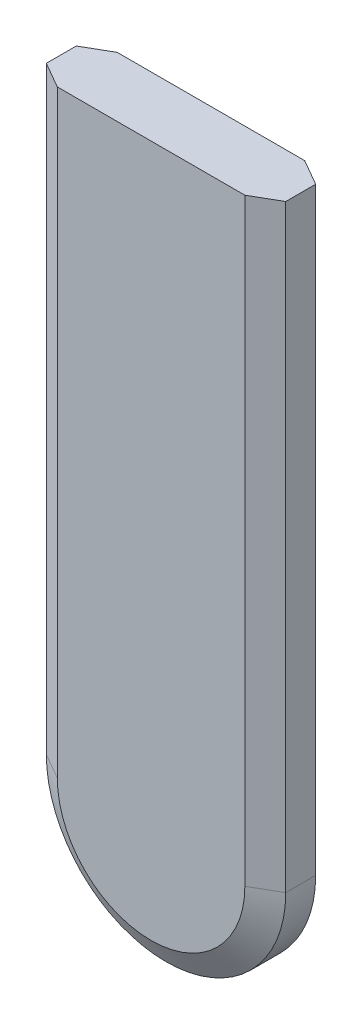
ISO-10303-21;
HEADER;
FILE_DESCRIPTION(('STEP AP214'),'2;1');
FILE_NAME('part.step','',(''),(''),'','','');
FILE_SCHEMA(('AUTOMOTIVE_DESIGN { 1 0 10303 214 1 1 1 1 }'));
ENDSEC;
DATA;
#1=APPLICATION_CONTEXT('core data for automotive mechanical design processes');
#2=APPLICATION_PROTOCOL_DEFINITION('international standard','automotive_design',2000,#1);
#3=PRODUCT_CONTEXT('',#1,'mechanical');
#4=PRODUCT('Part','Part','',(#3));
#5=PRODUCT_RELATED_PRODUCT_CATEGORY('part','',(#4));
#6=PRODUCT_DEFINITION_FORMATION('','',#4);
#7=PRODUCT_DEFINITION_CONTEXT('part definition',#1,'design');
#8=PRODUCT_DEFINITION('design','',#6,#7);
#9=PRODUCT_DEFINITION_SHAPE('','',#8);
#10=(LENGTH_UNIT() NAMED_UNIT(*) SI_UNIT(.MILLI.,.METRE.));
#11=(NAMED_UNIT(*) PLANE_ANGLE_UNIT() SI_UNIT($,.RADIAN.));
#12=(NAMED_UNIT(*) SI_UNIT($,.STERADIAN.) SOLID_ANGLE_UNIT());
#13=UNCERTAINTY_MEASURE_WITH_UNIT(LENGTH_MEASURE(1.E-05),#10,'distance_accuracy_value','');
#14=(GEOMETRIC_REPRESENTATION_CONTEXT(3) GLOBAL_UNCERTAINTY_ASSIGNED_CONTEXT((#13)) GLOBAL_UNIT_ASSIGNED_CONTEXT((#10,
#11,#12)) REPRESENTATION_CONTEXT('',''));
#15=CARTESIAN_POINT('',(0.,0.,0.));
#16=DIRECTION('',(0.,0.,1.));
#17=DIRECTION('',(1.,0.,0.));
#18=AXIS2_PLACEMENT_3D('',#15,#16,#17);
#19=CARTESIAN_POINT('',(25.4,0.,6.35));
#20=DIRECTION('',(0.,-1.,0.));
#21=DIRECTION('',(0.,0.,-1.));
#22=AXIS2_PLACEMENT_3D('',#19,#20,#21);
#23=PLANE('',#22);
#24=DIRECTION('',(-1.,0.,0.));
#25=VECTOR('',#24,1.);
#26=CARTESIAN_POINT('',(25.4,0.,0.));
#27=LINE('',#26,#25);
#28=CARTESIAN_POINT('',(22.6503693429844,0.,0.));
#29=VERTEX_POINT('',#28);
#30=CARTESIAN_POINT('',(2.74963065701558,0.,0.));
#31=VERTEX_POINT('',#30);
#32=EDGE_CURVE('E140',#29,#31,#27,.T.);
#33=ORIENTED_EDGE('',*,*,#32,.T.);
#34=DIRECTION('',(0.866025403784438,0.,-0.500000000000001));
#35=VECTOR('',#34,1.);
#36=CARTESIAN_POINT('',(0.,0.,1.5875));
#37=LINE('',#36,#35);
#38=CARTESIAN_POINT('',(0.,0.,1.5875));
#39=VERTEX_POINT('',#38);
#40=EDGE_CURVE('E195',#31,#39,#37,.F.);
#41=ORIENTED_EDGE('',*,*,#40,.T.);
#42=DIRECTION('',(0.,0.,-1.));
#43=VECTOR('',#42,1.);
#44=CARTESIAN_POINT('',(0.,0.,6.35));
#45=LINE('',#44,#43);
#46=CARTESIAN_POINT('',(0.,0.,4.76249999999999));
#47=VERTEX_POINT('',#46);
#48=EDGE_CURVE('E154',#47,#39,#45,.T.);
#49=ORIENTED_EDGE('',*,*,#48,.F.);
#50=DIRECTION('',(0.866025403784438,0.,0.500000000000001));
#51=VECTOR('',#50,1.);
#52=CARTESIAN_POINT('',(2.74963065701562,0.,6.35));
#53=LINE('',#52,#51);
#54=CARTESIAN_POINT('',(2.74963065701561,0.,6.35));
#55=VERTEX_POINT('',#54);
#56=EDGE_CURVE('E123',#47,#55,#53,.T.);
#57=ORIENTED_EDGE('',*,*,#56,.T.);
#58=DIRECTION('',(-1.,0.,0.));
#59=VECTOR('',#58,1.);
#60=CARTESIAN_POINT('',(25.4,0.,6.35));
#61=LINE('',#60,#59);
#62=CARTESIAN_POINT('',(22.6503693429844,0.,6.35));
#63=VERTEX_POINT('',#62);
#64=EDGE_CURVE('E128',#63,#55,#61,.T.);
#65=ORIENTED_EDGE('',*,*,#64,.F.);
#66=DIRECTION('',(0.866025403784438,0.,-0.5));
#67=VECTOR('',#66,1.);
#68=CARTESIAN_POINT('',(22.6503693429844,0.,6.35));
#69=LINE('',#68,#67);
#70=CARTESIAN_POINT('',(25.4,0.,4.76249999999999));
#71=VERTEX_POINT('',#70);
#72=EDGE_CURVE('E114',#63,#71,#69,.T.);
#73=ORIENTED_EDGE('',*,*,#72,.T.);
#74=DIRECTION('',(0.,0.,-1.));
#75=VECTOR('',#74,1.);
#76=CARTESIAN_POINT('',(25.4,0.,6.35));
#77=LINE('',#76,#75);
#78=CARTESIAN_POINT('',(25.4,0.,1.5875));
#79=VERTEX_POINT('',#78);
#80=EDGE_CURVE('E139',#71,#79,#77,.T.);
#81=ORIENTED_EDGE('',*,*,#80,.T.);
#82=DIRECTION('',(0.866025403784438,0.,0.500000000000001));
#83=VECTOR('',#82,1.);
#84=CARTESIAN_POINT('',(25.4,0.,1.5875));
#85=LINE('',#84,#83);
#86=EDGE_CURVE('E192',#79,#29,#85,.F.);
#87=ORIENTED_EDGE('',*,*,#86,.T.);
#88=EDGE_LOOP('',(#33,#41,#49,#57,#65,#73,#81,#87));
#89=FACE_BOUND('',#88,.T.);
#90=ADVANCED_FACE('F45',(#89),#23,.F.);
#91=CARTESIAN_POINT('',(0.,0.,6.35));
#92=DIRECTION('',(1.,0.,0.));
#93=DIRECTION('',(0.,1.,0.));
#94=AXIS2_PLACEMENT_3D('',#91,#92,#93);
#95=PLANE('',#94);
#96=ORIENTED_EDGE('',*,*,#48,.T.);
#97=DIRECTION('',(0.,-1.,0.));
#98=VECTOR('',#97,1.);
#99=CARTESIAN_POINT('',(0.,0.,1.5875));
#100=LINE('',#99,#98);
#101=CARTESIAN_POINT('',(0.,-63.5,1.5875));
#102=VERTEX_POINT('',#101);
#103=EDGE_CURVE('E173',#39,#102,#100,.T.);
#104=ORIENTED_EDGE('',*,*,#103,.T.);
#105=DIRECTION('',(0.,0.,-1.));
#106=VECTOR('',#105,1.);
#107=CARTESIAN_POINT('',(0.,-63.5,6.35));
#108=LINE('',#107,#106);
#109=CARTESIAN_POINT('',(0.,-63.5,4.76249999999999));
#110=VERTEX_POINT('',#109);
#111=EDGE_CURVE('E151',#110,#102,#108,.T.);
#112=ORIENTED_EDGE('',*,*,#111,.F.);
#113=DIRECTION('',(0.,1.,0.));
#114=VECTOR('',#113,1.);
#115=CARTESIAN_POINT('',(0.,0.,4.76249999999999));
#116=LINE('',#115,#114);
#117=EDGE_CURVE('E170',#110,#47,#116,.T.);
#118=ORIENTED_EDGE('',*,*,#117,.T.);
#119=EDGE_LOOP('',(#96,#104,#112,#118));
#120=FACE_BOUND('',#119,.T.);
#121=ADVANCED_FACE('F220',(#120),#95,.F.);
#122=CARTESIAN_POINT('',(12.7,-63.5,6.35));
#123=DIRECTION('',(0.,0.,-1.));
#124=DIRECTION('',(-1.,0.,0.));
#125=AXIS2_PLACEMENT_3D('',#122,#123,#124);
#126=CYLINDRICAL_SURFACE('',#125,12.7);
#127=ORIENTED_EDGE('',*,*,#111,.T.);
#128=CARTESIAN_POINT('',(12.7,-63.5,1.5875));
#129=DIRECTION('',(0.,0.,1.));
#130=DIRECTION('',(1.,0.,0.));
#131=AXIS2_PLACEMENT_3D('',#128,#129,#130);
#132=CIRCLE('',#131,12.7);
#133=CARTESIAN_POINT('',(25.4,-63.5,1.5875));
#134=VERTEX_POINT('',#133);
#135=EDGE_CURVE('E56',#102,#134,#132,.T.);
#136=ORIENTED_EDGE('',*,*,#135,.T.);
#137=DIRECTION('',(0.,0.,-1.));
#138=VECTOR('',#137,1.);
#139=CARTESIAN_POINT('',(25.4,-63.5,6.35));
#140=LINE('',#139,#138);
#141=CARTESIAN_POINT('',(25.4,-63.5,4.76249999999999));
#142=VERTEX_POINT('',#141);
#143=EDGE_CURVE('E144',#142,#134,#140,.T.);
#144=ORIENTED_EDGE('',*,*,#143,.F.);
#145=CARTESIAN_POINT('',(12.7,-63.5,4.76249999999999));
#146=DIRECTION('',(0.,0.,1.));
#147=DIRECTION('',(1.,0.,0.));
#148=AXIS2_PLACEMENT_3D('',#145,#146,#147);
#149=CIRCLE('',#148,12.7);
#150=EDGE_CURVE('E167',#142,#110,#149,.F.);
#151=ORIENTED_EDGE('',*,*,#150,.T.);
#152=EDGE_LOOP('',(#127,#136,#144,#151));
#153=FACE_BOUND('',#152,.T.);
#154=ADVANCED_FACE('F229',(#153),#126,.T.);
#155=CARTESIAN_POINT('',(25.4,-63.5,6.35));
#156=DIRECTION('',(-1.,0.,0.));
#157=DIRECTION('',(0.,0.,1.));
#158=AXIS2_PLACEMENT_3D('',#155,#156,#157);
#159=PLANE('',#158);
#160=ORIENTED_EDGE('',*,*,#143,.T.);
#161=DIRECTION('',(0.,1.,0.));
#162=VECTOR('',#161,1.);
#163=CARTESIAN_POINT('',(25.4,-63.5,1.5875));
#164=LINE('',#163,#162);
#165=EDGE_CURVE('E11',#134,#79,#164,.T.);
#166=ORIENTED_EDGE('',*,*,#165,.T.);
#167=ORIENTED_EDGE('',*,*,#80,.F.);
#168=DIRECTION('',(0.,-1.,0.));
#169=VECTOR('',#168,1.);
#170=CARTESIAN_POINT('',(25.4,-63.5,4.76249999999999));
#171=LINE('',#170,#169);
#172=EDGE_CURVE('E119',#71,#142,#171,.T.);
#173=ORIENTED_EDGE('',*,*,#172,.T.);
#174=EDGE_LOOP('',(#160,#166,#167,#173));
#175=FACE_BOUND('',#174,.T.);
#176=ADVANCED_FACE('F230',(#175),#159,.F.);
#177=CARTESIAN_POINT('',(12.7,-63.5,6.35));
#178=DIRECTION('',(0.,0.,1.));
#179=DIRECTION('',(1.,0.,0.));
#180=AXIS2_PLACEMENT_3D('',#177,#178,#179);
#181=PLANE('',#180);
#182=CARTESIAN_POINT('',(12.7,-63.5,6.35));
#183=DIRECTION('',(0.,0.,1.));
#184=DIRECTION('',(1.,0.,0.));
#185=AXIS2_PLACEMENT_3D('',#182,#183,#184);
#186=CIRCLE('',#185,9.95036934298438);
#187=CARTESIAN_POINT('',(2.74963065701562,-63.5,6.35));
#188=VERTEX_POINT('',#187);
#189=CARTESIAN_POINT('',(22.6503693429844,-63.5,6.35));
#190=VERTEX_POINT('',#189);
#191=EDGE_CURVE('E131',#188,#190,#186,.T.);
#192=ORIENTED_EDGE('',*,*,#191,.T.);
#193=DIRECTION('',(0.,1.,0.));
#194=VECTOR('',#193,1.);
#195=CARTESIAN_POINT('',(22.6503693429844,0.,6.35));
#196=LINE('',#195,#194);
#197=EDGE_CURVE('E118',#190,#63,#196,.T.);
#198=ORIENTED_EDGE('',*,*,#197,.T.);
#199=ORIENTED_EDGE('',*,*,#64,.T.);
#200=DIRECTION('',(0.,-1.,0.));
#201=VECTOR('',#200,1.);
#202=CARTESIAN_POINT('',(2.74963065701562,-63.5,6.35));
#203=LINE('',#202,#201);
#204=EDGE_CURVE('E158',#55,#188,#203,.T.);
#205=ORIENTED_EDGE('',*,*,#204,.T.);
#206=EDGE_LOOP('',(#192,#198,#199,#205));
#207=FACE_BOUND('',#206,.T.);
#208=ADVANCED_FACE('F127',(#207),#181,.T.);
#209=CARTESIAN_POINT('',(12.7,-63.5,0.));
#210=DIRECTION('',(0.,0.,1.));
#211=DIRECTION('',(1.,0.,0.));
#212=AXIS2_PLACEMENT_3D('',#209,#210,#211);
#213=PLANE('',#212);
#214=CARTESIAN_POINT('',(12.7,-63.5,0.));
#215=DIRECTION('',(0.,0.,1.));
#216=DIRECTION('',(1.,0.,0.));
#217=AXIS2_PLACEMENT_3D('',#214,#215,#216);
#218=CIRCLE('',#217,9.95036934298441);
#219=CARTESIAN_POINT('',(22.6503693429844,-63.5,0.));
#220=VERTEX_POINT('',#219);
#221=CARTESIAN_POINT('',(2.74963065701559,-63.5,0.));
#222=VERTEX_POINT('',#221);
#223=EDGE_CURVE('E186',#220,#222,#218,.F.);
#224=ORIENTED_EDGE('',*,*,#223,.T.);
#225=DIRECTION('',(0.,1.,0.));
#226=VECTOR('',#225,1.);
#227=CARTESIAN_POINT('',(2.74963065701559,-63.5,0.));
#228=LINE('',#227,#226);
#229=EDGE_CURVE('E189',#222,#31,#228,.T.);
#230=ORIENTED_EDGE('',*,*,#229,.T.);
#231=ORIENTED_EDGE('',*,*,#32,.F.);
#232=DIRECTION('',(0.,-1.,0.));
#233=VECTOR('',#232,1.);
#234=CARTESIAN_POINT('',(22.6503693429844,-63.5,0.));
#235=LINE('',#234,#233);
#236=EDGE_CURVE('E183',#29,#220,#235,.T.);
#237=ORIENTED_EDGE('',*,*,#236,.T.);
#238=EDGE_LOOP('',(#224,#230,#231,#237));
#239=FACE_BOUND('',#238,.T.);
#240=ADVANCED_FACE('F217',(#239),#213,.F.);
#241=CARTESIAN_POINT('',(2.74963065701562,-63.5,6.35));
#242=DIRECTION('',(-0.5,0.,0.866025403784438));
#243=DIRECTION('',(0.,1.,0.));
#244=AXIS2_PLACEMENT_3D('',#241,#242,#243);
#245=PLANE('',#244);
#246=ORIENTED_EDGE('',*,*,#56,.F.);
#247=ORIENTED_EDGE('',*,*,#117,.F.);
#248=DIRECTION('',(-0.866025403784438,0.,-0.5));
#249=VECTOR('',#248,1.);
#250=CARTESIAN_POINT('',(2.74963065701562,-63.5,6.35));
#251=LINE('',#250,#249);
#252=EDGE_CURVE('E146',#188,#110,#251,.T.);
#253=ORIENTED_EDGE('',*,*,#252,.F.);
#254=ORIENTED_EDGE('',*,*,#204,.F.);
#255=EDGE_LOOP('',(#246,#247,#253,#254));
#256=FACE_BOUND('',#255,.T.);
#257=ADVANCED_FACE('F225',(#256),#245,.T.);
#258=CARTESIAN_POINT('',(12.7,-63.5,6.35));
#259=DIRECTION('',(0.,0.,-1.));
#260=DIRECTION('',(-1.,0.,0.));
#261=AXIS2_PLACEMENT_3D('',#258,#259,#260);
#262=CONICAL_SURFACE('',#261,9.95036934298438,1.0471975511966);
#263=ORIENTED_EDGE('',*,*,#252,.T.);
#264=ORIENTED_EDGE('',*,*,#150,.F.);
#265=DIRECTION('',(0.866025403784438,0.,-0.5));
#266=VECTOR('',#265,1.);
#267=CARTESIAN_POINT('',(22.6503693429844,-63.5,6.35));
#268=LINE('',#267,#266);
#269=EDGE_CURVE('E174',#190,#142,#268,.T.);
#270=ORIENTED_EDGE('',*,*,#269,.F.);
#271=ORIENTED_EDGE('',*,*,#191,.F.);
#272=EDGE_LOOP('',(#263,#264,#270,#271));
#273=FACE_BOUND('',#272,.T.);
#274=ADVANCED_FACE('F228',(#273),#262,.T.);
#275=CARTESIAN_POINT('',(22.6503693429844,-63.5,6.35));
#276=DIRECTION('',(0.5,0.,0.866025403784438));
#277=DIRECTION('',(0.,-1.,0.));
#278=AXIS2_PLACEMENT_3D('',#275,#276,#277);
#279=PLANE('',#278);
#280=ORIENTED_EDGE('',*,*,#269,.T.);
#281=ORIENTED_EDGE('',*,*,#172,.F.);
#282=ORIENTED_EDGE('',*,*,#72,.F.);
#283=ORIENTED_EDGE('',*,*,#197,.F.);
#284=EDGE_LOOP('',(#280,#281,#282,#283));
#285=FACE_BOUND('',#284,.T.);
#286=ADVANCED_FACE('F117',(#285),#279,.T.);
#287=CARTESIAN_POINT('',(25.4,-63.5,1.5875));
#288=DIRECTION('',(-0.500000000000001,0.,0.866025403784438));
#289=DIRECTION('',(0.,1.,0.));
#290=AXIS2_PLACEMENT_3D('',#287,#288,#289);
#291=PLANE('',#290);
#292=ORIENTED_EDGE('',*,*,#86,.F.);
#293=ORIENTED_EDGE('',*,*,#165,.F.);
#294=DIRECTION('',(0.866025403784438,0.,0.500000000000001));
#295=VECTOR('',#294,1.);
#296=CARTESIAN_POINT('',(22.6503693429844,-63.5,0.));
#297=LINE('',#296,#295);
#298=EDGE_CURVE('E50',#220,#134,#297,.T.);
#299=ORIENTED_EDGE('',*,*,#298,.F.);
#300=ORIENTED_EDGE('',*,*,#236,.F.);
#301=EDGE_LOOP('',(#292,#293,#299,#300));
#302=FACE_BOUND('',#301,.T.);
#303=ADVANCED_FACE('F48',(#302),#291,.F.);
#304=CARTESIAN_POINT('',(12.7,-63.5,1.5875));
#305=DIRECTION('',(0.,0.,1.));
#306=DIRECTION('',(1.,0.,0.));
#307=AXIS2_PLACEMENT_3D('',#304,#305,#306);
#308=CONICAL_SURFACE('',#307,12.7,1.0471975511966);
#309=ORIENTED_EDGE('',*,*,#298,.T.);
#310=ORIENTED_EDGE('',*,*,#135,.F.);
#311=DIRECTION('',(-0.866025403784438,0.,0.500000000000001));
#312=VECTOR('',#311,1.);
#313=CARTESIAN_POINT('',(2.74963065701559,-63.5,0.));
#314=LINE('',#313,#312);
#315=EDGE_CURVE('E199',#222,#102,#314,.T.);
#316=ORIENTED_EDGE('',*,*,#315,.F.);
#317=ORIENTED_EDGE('',*,*,#223,.F.);
#318=EDGE_LOOP('',(#309,#310,#316,#317));
#319=FACE_BOUND('',#318,.T.);
#320=ADVANCED_FACE('F210',(#319),#308,.T.);
#321=CARTESIAN_POINT('',(0.,0.,1.5875));
#322=DIRECTION('',(0.500000000000001,0.,0.866025403784438));
#323=DIRECTION('',(0.,-1.,0.));
#324=AXIS2_PLACEMENT_3D('',#321,#322,#323);
#325=PLANE('',#324);
#326=ORIENTED_EDGE('',*,*,#40,.F.);
#327=ORIENTED_EDGE('',*,*,#229,.F.);
#328=ORIENTED_EDGE('',*,*,#315,.T.);
#329=ORIENTED_EDGE('',*,*,#103,.F.);
#330=EDGE_LOOP('',(#326,#327,#328,#329));
#331=FACE_BOUND('',#330,.T.);
#332=ADVANCED_FACE('F218',(#331),#325,.F.);
#333=CLOSED_SHELL('',(#90,#121,#154,#176,#208,#240,#257,#274,#286,#303,#320,#332));
#334=MANIFOLD_SOLID_BREP('B2',#333);
#335=ADVANCED_BREP_SHAPE_REPRESENTATION('',(#18,#334),#14);
#336=SHAPE_DEFINITION_REPRESENTATION(#9,#335);
ENDSEC;
END-ISO-10303-21;
